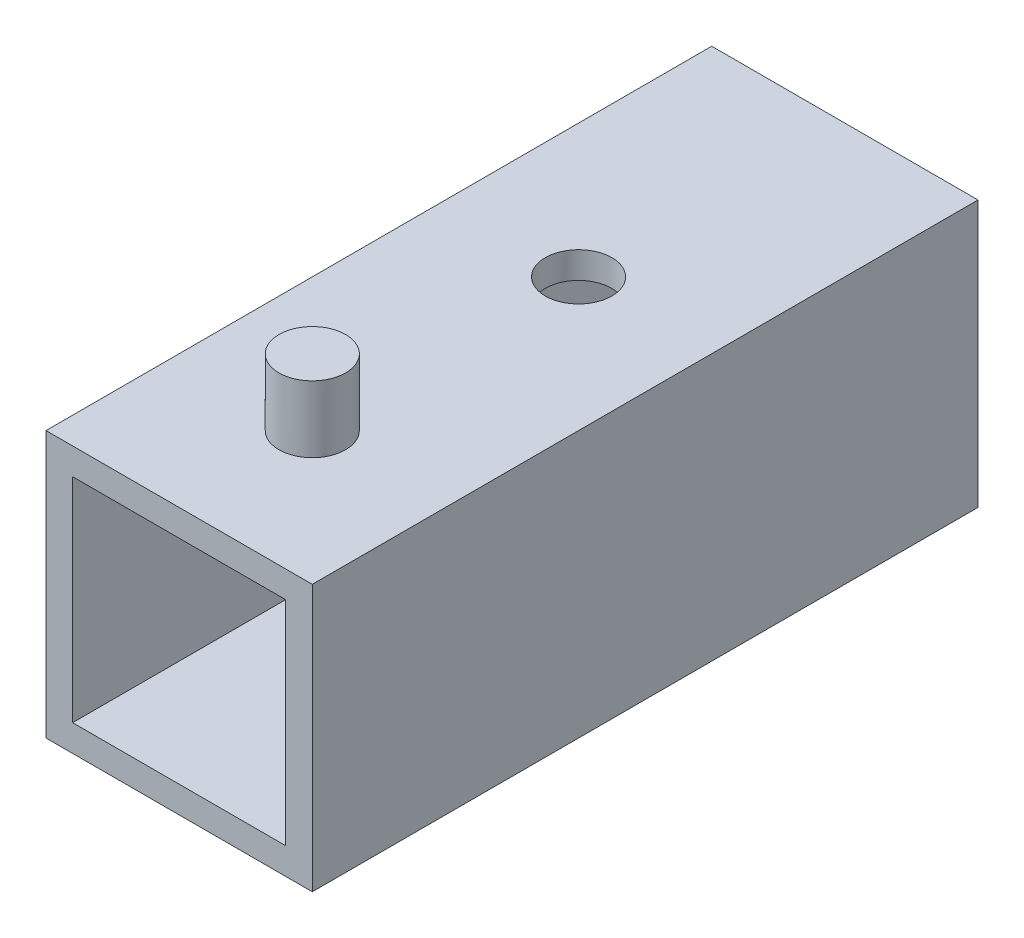
ISO-10303-21;
HEADER;
FILE_DESCRIPTION(('STEP AP214'),'2;1');
FILE_NAME('part.step','',(''),(''),'','','');
FILE_SCHEMA(('AUTOMOTIVE_DESIGN { 1 0 10303 214 1 1 1 1 }'));
ENDSEC;
DATA;
#1=APPLICATION_CONTEXT('core data for automotive mechanical design processes');
#2=APPLICATION_PROTOCOL_DEFINITION('international standard','automotive_design',2000,#1);
#3=PRODUCT_CONTEXT('',#1,'mechanical');
#4=PRODUCT('Part','Part','',(#3));
#5=PRODUCT_RELATED_PRODUCT_CATEGORY('part','',(#4));
#6=PRODUCT_DEFINITION_FORMATION('','',#4);
#7=PRODUCT_DEFINITION_CONTEXT('part definition',#1,'design');
#8=PRODUCT_DEFINITION('design','',#6,#7);
#9=PRODUCT_DEFINITION_SHAPE('','',#8);
#10=(LENGTH_UNIT() NAMED_UNIT(*) SI_UNIT(.MILLI.,.METRE.));
#11=(NAMED_UNIT(*) PLANE_ANGLE_UNIT() SI_UNIT($,.RADIAN.));
#12=(NAMED_UNIT(*) SI_UNIT($,.STERADIAN.) SOLID_ANGLE_UNIT());
#13=UNCERTAINTY_MEASURE_WITH_UNIT(LENGTH_MEASURE(1.E-05),#10,'distance_accuracy_value','');
#14=(GEOMETRIC_REPRESENTATION_CONTEXT(3) GLOBAL_UNCERTAINTY_ASSIGNED_CONTEXT((#13)) GLOBAL_UNIT_ASSIGNED_CONTEXT((#10,
#11,#12)) REPRESENTATION_CONTEXT('',''));
#15=CARTESIAN_POINT('',(0.,0.,0.));
#16=DIRECTION('',(0.,0.,1.));
#17=DIRECTION('',(1.,0.,0.));
#18=AXIS2_PLACEMENT_3D('',#15,#16,#17);
#19=CARTESIAN_POINT('',(0.,0.,31.75));
#20=DIRECTION('',(0.,0.,1.));
#21=DIRECTION('',(1.,0.,0.));
#22=AXIS2_PLACEMENT_3D('',#19,#20,#21);
#23=PLANE('',#22);
#24=DIRECTION('',(0.,1.,0.));
#25=VECTOR('',#24,1.);
#26=CARTESIAN_POINT('',(12.7,-12.7,31.75));
#27=LINE('',#26,#25);
#28=CARTESIAN_POINT('',(12.7,-12.7,31.75));
#29=VERTEX_POINT('',#28);
#30=CARTESIAN_POINT('',(12.7,12.7,31.75));
#31=VERTEX_POINT('',#30);
#32=EDGE_CURVE('E162',#29,#31,#27,.T.);
#33=ORIENTED_EDGE('',*,*,#32,.T.);
#34=DIRECTION('',(-1.,0.,0.));
#35=VECTOR('',#34,1.);
#36=CARTESIAN_POINT('',(-12.7,12.7,31.75));
#37=LINE('',#36,#35);
#38=CARTESIAN_POINT('',(-12.7,12.7,31.75));
#39=VERTEX_POINT('',#38);
#40=EDGE_CURVE('E165',#31,#39,#37,.T.);
#41=ORIENTED_EDGE('',*,*,#40,.T.);
#42=DIRECTION('',(0.,-1.,0.));
#43=VECTOR('',#42,1.);
#44=CARTESIAN_POINT('',(-12.7,-12.7,31.75));
#45=LINE('',#44,#43);
#46=CARTESIAN_POINT('',(-12.7,-12.7,31.75));
#47=VERTEX_POINT('',#46);
#48=EDGE_CURVE('E168',#39,#47,#45,.T.);
#49=ORIENTED_EDGE('',*,*,#48,.T.);
#50=DIRECTION('',(1.,0.,0.));
#51=VECTOR('',#50,1.);
#52=CARTESIAN_POINT('',(-12.7,-12.7,31.75));
#53=LINE('',#52,#51);
#54=EDGE_CURVE('E170',#47,#29,#53,.T.);
#55=ORIENTED_EDGE('',*,*,#54,.T.);
#56=EDGE_LOOP('',(#33,#41,#49,#55));
#57=FACE_BOUND('',#56,.T.);
#58=DIRECTION('',(-1.,0.,0.));
#59=VECTOR('',#58,1.);
#60=CARTESIAN_POINT('',(0.,10.16,31.75));
#61=LINE('',#60,#59);
#62=CARTESIAN_POINT('',(10.16,10.16,31.75));
#63=VERTEX_POINT('',#62);
#64=CARTESIAN_POINT('',(-10.16,10.16,31.75));
#65=VERTEX_POINT('',#64);
#66=EDGE_CURVE('E132',#63,#65,#61,.T.);
#67=ORIENTED_EDGE('',*,*,#66,.F.);
#68=DIRECTION('',(0.,1.,0.));
#69=VECTOR('',#68,1.);
#70=CARTESIAN_POINT('',(10.16,0.,31.75));
#71=LINE('',#70,#69);
#72=CARTESIAN_POINT('',(10.16,-10.16,31.75));
#73=VERTEX_POINT('',#72);
#74=EDGE_CURVE('E124',#73,#63,#71,.T.);
#75=ORIENTED_EDGE('',*,*,#74,.F.);
#76=DIRECTION('',(1.,0.,0.));
#77=VECTOR('',#76,1.);
#78=CARTESIAN_POINT('',(0.,-10.16,31.75));
#79=LINE('',#78,#77);
#80=CARTESIAN_POINT('',(-10.16,-10.16,31.75));
#81=VERTEX_POINT('',#80);
#82=EDGE_CURVE('E146',#81,#73,#79,.T.);
#83=ORIENTED_EDGE('',*,*,#82,.F.);
#84=DIRECTION('',(0.,-1.,0.));
#85=VECTOR('',#84,1.);
#86=CARTESIAN_POINT('',(-10.16,0.,31.75));
#87=LINE('',#86,#85);
#88=EDGE_CURVE('E144',#65,#81,#87,.T.);
#89=ORIENTED_EDGE('',*,*,#88,.F.);
#90=EDGE_LOOP('',(#67,#75,#83,#89));
#91=FACE_BOUND('',#90,.T.);
#92=ADVANCED_FACE('F58',(#57,#91),#23,.T.);
#93=CARTESIAN_POINT('',(0.,0.,-31.75));
#94=DIRECTION('',(0.,0.,1.));
#95=DIRECTION('',(1.,0.,0.));
#96=AXIS2_PLACEMENT_3D('',#93,#94,#95);
#97=PLANE('',#96);
#98=DIRECTION('',(0.,1.,0.));
#99=VECTOR('',#98,1.);
#100=CARTESIAN_POINT('',(12.7,-12.7,-31.75));
#101=LINE('',#100,#99);
#102=CARTESIAN_POINT('',(12.7,-12.7,-31.75));
#103=VERTEX_POINT('',#102);
#104=CARTESIAN_POINT('',(12.7,12.7,-31.75));
#105=VERTEX_POINT('',#104);
#106=EDGE_CURVE('E140',#103,#105,#101,.T.);
#107=ORIENTED_EDGE('',*,*,#106,.F.);
#108=DIRECTION('',(1.,0.,0.));
#109=VECTOR('',#108,1.);
#110=CARTESIAN_POINT('',(-12.7,-12.7,-31.75));
#111=LINE('',#110,#109);
#112=CARTESIAN_POINT('',(-12.7,-12.7,-31.75));
#113=VERTEX_POINT('',#112);
#114=EDGE_CURVE('E166',#113,#103,#111,.T.);
#115=ORIENTED_EDGE('',*,*,#114,.F.);
#116=DIRECTION('',(0.,-1.,0.));
#117=VECTOR('',#116,1.);
#118=CARTESIAN_POINT('',(-12.7,-12.7,-31.75));
#119=LINE('',#118,#117);
#120=CARTESIAN_POINT('',(-12.7,12.7,-31.75));
#121=VERTEX_POINT('',#120);
#122=EDGE_CURVE('E177',#121,#113,#119,.T.);
#123=ORIENTED_EDGE('',*,*,#122,.F.);
#124=DIRECTION('',(-1.,0.,0.));
#125=VECTOR('',#124,1.);
#126=CARTESIAN_POINT('',(-12.7,12.7,-31.75));
#127=LINE('',#126,#125);
#128=EDGE_CURVE('E175',#105,#121,#127,.T.);
#129=ORIENTED_EDGE('',*,*,#128,.F.);
#130=EDGE_LOOP('',(#107,#115,#123,#129));
#131=FACE_BOUND('',#130,.T.);
#132=DIRECTION('',(0.,1.,0.));
#133=VECTOR('',#132,1.);
#134=CARTESIAN_POINT('',(10.16,0.,-31.75));
#135=LINE('',#134,#133);
#136=CARTESIAN_POINT('',(10.16,-10.16,-31.75));
#137=VERTEX_POINT('',#136);
#138=CARTESIAN_POINT('',(10.16,10.16,-31.75));
#139=VERTEX_POINT('',#138);
#140=EDGE_CURVE('E82',#137,#139,#135,.T.);
#141=ORIENTED_EDGE('',*,*,#140,.T.);
#142=DIRECTION('',(-1.,0.,0.));
#143=VECTOR('',#142,1.);
#144=CARTESIAN_POINT('',(0.,10.16,-31.75));
#145=LINE('',#144,#143);
#146=CARTESIAN_POINT('',(-10.16,10.16,-31.75));
#147=VERTEX_POINT('',#146);
#148=EDGE_CURVE('E139',#139,#147,#145,.T.);
#149=ORIENTED_EDGE('',*,*,#148,.T.);
#150=DIRECTION('',(0.,-1.,0.));
#151=VECTOR('',#150,1.);
#152=CARTESIAN_POINT('',(-10.16,0.,-31.75));
#153=LINE('',#152,#151);
#154=CARTESIAN_POINT('',(-10.16,-10.16,-31.75));
#155=VERTEX_POINT('',#154);
#156=EDGE_CURVE('E154',#147,#155,#153,.T.);
#157=ORIENTED_EDGE('',*,*,#156,.T.);
#158=DIRECTION('',(1.,0.,0.));
#159=VECTOR('',#158,1.);
#160=CARTESIAN_POINT('',(0.,-10.16,-31.75));
#161=LINE('',#160,#159);
#162=EDGE_CURVE('E133',#155,#137,#161,.T.);
#163=ORIENTED_EDGE('',*,*,#162,.T.);
#164=EDGE_LOOP('',(#141,#149,#157,#163));
#165=FACE_BOUND('',#164,.T.);
#166=ADVANCED_FACE('F199',(#131,#165),#97,.F.);
#167=CARTESIAN_POINT('',(12.7,-12.7,31.75));
#168=DIRECTION('',(-1.,0.,0.));
#169=DIRECTION('',(0.,0.,1.));
#170=AXIS2_PLACEMENT_3D('',#167,#168,#169);
#171=PLANE('',#170);
#172=ORIENTED_EDGE('',*,*,#106,.T.);
#173=DIRECTION('',(0.,0.,-1.));
#174=VECTOR('',#173,1.);
#175=CARTESIAN_POINT('',(12.7,12.7,31.75));
#176=LINE('',#175,#174);
#177=EDGE_CURVE('E67',#31,#105,#176,.T.);
#178=ORIENTED_EDGE('',*,*,#177,.F.);
#179=ORIENTED_EDGE('',*,*,#32,.F.);
#180=DIRECTION('',(0.,0.,-1.));
#181=VECTOR('',#180,1.);
#182=CARTESIAN_POINT('',(12.7,-12.7,31.75));
#183=LINE('',#182,#181);
#184=EDGE_CURVE('E172',#29,#103,#183,.T.);
#185=ORIENTED_EDGE('',*,*,#184,.T.);
#186=EDGE_LOOP('',(#172,#178,#179,#185));
#187=FACE_BOUND('',#186,.T.);
#188=ADVANCED_FACE('F60',(#187),#171,.F.);
#189=CARTESIAN_POINT('',(-12.7,12.7,31.75));
#190=DIRECTION('',(0.,-1.,0.));
#191=DIRECTION('',(0.,0.,-1.));
#192=AXIS2_PLACEMENT_3D('',#189,#190,#191);
#193=PLANE('',#192);
#194=CARTESIAN_POINT('',(0.,12.7,-6.35));
#195=DIRECTION('',(0.,1.,0.));
#196=DIRECTION('',(0.,0.,1.));
#197=AXIS2_PLACEMENT_3D('',#194,#195,#196);
#198=CIRCLE('',#197,3.175);
#199=CARTESIAN_POINT('',(0.,12.7,-3.175));
#200=VERTEX_POINT('',#199);
#201=EDGE_CURVE('E231',#200,#200,#198,.T.);
#202=ORIENTED_EDGE('',*,*,#201,.F.);
#203=EDGE_LOOP('',(#202));
#204=FACE_BOUND('',#203,.T.);
#205=CARTESIAN_POINT('',(0.,12.7,19.05));
#206=DIRECTION('',(0.,-1.,0.));
#207=DIRECTION('',(0.,0.,-1.));
#208=AXIS2_PLACEMENT_3D('',#205,#206,#207);
#209=CIRCLE('',#208,3.175);
#210=CARTESIAN_POINT('',(0.,12.7,15.875));
#211=VERTEX_POINT('',#210);
#212=EDGE_CURVE('E12',#211,#211,#209,.F.);
#213=ORIENTED_EDGE('',*,*,#212,.F.);
#214=EDGE_LOOP('',(#213));
#215=FACE_BOUND('',#214,.T.);
#216=ORIENTED_EDGE('',*,*,#128,.T.);
#217=DIRECTION('',(0.,0.,-1.));
#218=VECTOR('',#217,1.);
#219=CARTESIAN_POINT('',(-12.7,12.7,31.75));
#220=LINE('',#219,#218);
#221=EDGE_CURVE('E185',#39,#121,#220,.T.);
#222=ORIENTED_EDGE('',*,*,#221,.F.);
#223=ORIENTED_EDGE('',*,*,#40,.F.);
#224=ORIENTED_EDGE('',*,*,#177,.T.);
#225=EDGE_LOOP('',(#216,#222,#223,#224));
#226=FACE_BOUND('',#225,.T.);
#227=ADVANCED_FACE('F191',(#204,#215,#226),#193,.F.);
#228=CARTESIAN_POINT('',(-12.7,-12.7,31.75));
#229=DIRECTION('',(1.,0.,0.));
#230=DIRECTION('',(0.,0.,-1.));
#231=AXIS2_PLACEMENT_3D('',#228,#229,#230);
#232=PLANE('',#231);
#233=ORIENTED_EDGE('',*,*,#122,.T.);
#234=DIRECTION('',(0.,0.,-1.));
#235=VECTOR('',#234,1.);
#236=CARTESIAN_POINT('',(-12.7,-12.7,31.75));
#237=LINE('',#236,#235);
#238=EDGE_CURVE('E182',#47,#113,#237,.T.);
#239=ORIENTED_EDGE('',*,*,#238,.F.);
#240=ORIENTED_EDGE('',*,*,#48,.F.);
#241=ORIENTED_EDGE('',*,*,#221,.T.);
#242=EDGE_LOOP('',(#233,#239,#240,#241));
#243=FACE_BOUND('',#242,.T.);
#244=ADVANCED_FACE('F204',(#243),#232,.F.);
#245=CARTESIAN_POINT('',(-12.7,-12.7,31.75));
#246=DIRECTION('',(0.,1.,0.));
#247=DIRECTION('',(0.,0.,1.));
#248=AXIS2_PLACEMENT_3D('',#245,#246,#247);
#249=PLANE('',#248);
#250=CARTESIAN_POINT('',(0.,-12.7,-6.35));
#251=DIRECTION('',(0.,1.,0.));
#252=DIRECTION('',(0.,0.,1.));
#253=AXIS2_PLACEMENT_3D('',#250,#251,#252);
#254=CIRCLE('',#253,3.175);
#255=CARTESIAN_POINT('',(0.,-12.7,-3.175));
#256=VERTEX_POINT('',#255);
#257=EDGE_CURVE('E267',#256,#256,#254,.T.);
#258=ORIENTED_EDGE('',*,*,#257,.T.);
#259=EDGE_LOOP('',(#258));
#260=FACE_BOUND('',#259,.T.);
#261=ORIENTED_EDGE('',*,*,#114,.T.);
#262=ORIENTED_EDGE('',*,*,#184,.F.);
#263=ORIENTED_EDGE('',*,*,#54,.F.);
#264=ORIENTED_EDGE('',*,*,#238,.T.);
#265=EDGE_LOOP('',(#261,#262,#263,#264));
#266=FACE_BOUND('',#265,.T.);
#267=ADVANCED_FACE('F208',(#260,#266),#249,.F.);
#268=CARTESIAN_POINT('',(10.16,0.,31.75));
#269=DIRECTION('',(-1.,0.,0.));
#270=DIRECTION('',(0.,0.,1.));
#271=AXIS2_PLACEMENT_3D('',#268,#269,#270);
#272=PLANE('',#271);
#273=ORIENTED_EDGE('',*,*,#140,.F.);
#274=DIRECTION('',(0.,0.,-1.));
#275=VECTOR('',#274,1.);
#276=CARTESIAN_POINT('',(10.16,-10.16,31.75));
#277=LINE('',#276,#275);
#278=EDGE_CURVE('E128',#73,#137,#277,.T.);
#279=ORIENTED_EDGE('',*,*,#278,.F.);
#280=ORIENTED_EDGE('',*,*,#74,.T.);
#281=DIRECTION('',(0.,0.,-1.));
#282=VECTOR('',#281,1.);
#283=CARTESIAN_POINT('',(10.16,10.16,31.75));
#284=LINE('',#283,#282);
#285=EDGE_CURVE('E127',#63,#139,#284,.T.);
#286=ORIENTED_EDGE('',*,*,#285,.T.);
#287=EDGE_LOOP('',(#273,#279,#280,#286));
#288=FACE_BOUND('',#287,.T.);
#289=ADVANCED_FACE('F126',(#288),#272,.T.);
#290=CARTESIAN_POINT('',(0.,10.16,31.75));
#291=DIRECTION('',(0.,-1.,0.));
#292=DIRECTION('',(0.,0.,-1.));
#293=AXIS2_PLACEMENT_3D('',#290,#291,#292);
#294=PLANE('',#293);
#295=CARTESIAN_POINT('',(0.,10.16,-6.35));
#296=DIRECTION('',(0.,-1.,0.));
#297=DIRECTION('',(0.,0.,-1.));
#298=AXIS2_PLACEMENT_3D('',#295,#296,#297);
#299=CIRCLE('',#298,3.175);
#300=CARTESIAN_POINT('',(0.,10.16,-9.525));
#301=VERTEX_POINT('',#300);
#302=EDGE_CURVE('E262',#301,#301,#299,.T.);
#303=ORIENTED_EDGE('',*,*,#302,.F.);
#304=EDGE_LOOP('',(#303));
#305=FACE_BOUND('',#304,.T.);
#306=ORIENTED_EDGE('',*,*,#148,.F.);
#307=ORIENTED_EDGE('',*,*,#285,.F.);
#308=ORIENTED_EDGE('',*,*,#66,.T.);
#309=DIRECTION('',(0.,0.,-1.));
#310=VECTOR('',#309,1.);
#311=CARTESIAN_POINT('',(-10.16,10.16,31.75));
#312=LINE('',#311,#310);
#313=EDGE_CURVE('E141',#65,#147,#312,.T.);
#314=ORIENTED_EDGE('',*,*,#313,.T.);
#315=EDGE_LOOP('',(#306,#307,#308,#314));
#316=FACE_BOUND('',#315,.T.);
#317=ADVANCED_FACE('F136',(#305,#316),#294,.T.);
#318=CARTESIAN_POINT('',(-10.16,0.,31.75));
#319=DIRECTION('',(1.,0.,0.));
#320=DIRECTION('',(0.,0.,-1.));
#321=AXIS2_PLACEMENT_3D('',#318,#319,#320);
#322=PLANE('',#321);
#323=ORIENTED_EDGE('',*,*,#156,.F.);
#324=ORIENTED_EDGE('',*,*,#313,.F.);
#325=ORIENTED_EDGE('',*,*,#88,.T.);
#326=DIRECTION('',(0.,0.,-1.));
#327=VECTOR('',#326,1.);
#328=CARTESIAN_POINT('',(-10.16,-10.16,31.75));
#329=LINE('',#328,#327);
#330=EDGE_CURVE('E74',#81,#155,#329,.T.);
#331=ORIENTED_EDGE('',*,*,#330,.T.);
#332=EDGE_LOOP('',(#323,#324,#325,#331));
#333=FACE_BOUND('',#332,.T.);
#334=ADVANCED_FACE('F247',(#333),#322,.T.);
#335=CARTESIAN_POINT('',(0.,-10.16,31.75));
#336=DIRECTION('',(0.,1.,0.));
#337=DIRECTION('',(0.,0.,1.));
#338=AXIS2_PLACEMENT_3D('',#335,#336,#337);
#339=PLANE('',#338);
#340=CARTESIAN_POINT('',(0.,-10.16,-6.35));
#341=DIRECTION('',(0.,1.,0.));
#342=DIRECTION('',(0.,0.,1.));
#343=AXIS2_PLACEMENT_3D('',#340,#341,#342);
#344=CIRCLE('',#343,3.175);
#345=CARTESIAN_POINT('',(0.,-10.16,-3.175));
#346=VERTEX_POINT('',#345);
#347=EDGE_CURVE('E62',#346,#346,#344,.T.);
#348=ORIENTED_EDGE('',*,*,#347,.F.);
#349=EDGE_LOOP('',(#348));
#350=FACE_BOUND('',#349,.T.);
#351=ORIENTED_EDGE('',*,*,#162,.F.);
#352=ORIENTED_EDGE('',*,*,#330,.F.);
#353=ORIENTED_EDGE('',*,*,#82,.T.);
#354=ORIENTED_EDGE('',*,*,#278,.T.);
#355=EDGE_LOOP('',(#351,#352,#353,#354));
#356=FACE_BOUND('',#355,.T.);
#357=ADVANCED_FACE('F237',(#350,#356),#339,.T.);
#358=CARTESIAN_POINT('',(0.,19.05,19.05));
#359=DIRECTION('',(0.,-1.,0.));
#360=DIRECTION('',(0.,0.,-1.));
#361=AXIS2_PLACEMENT_3D('',#358,#359,#360);
#362=CYLINDRICAL_SURFACE('',#361,3.175);
#363=CARTESIAN_POINT('',(0.,19.05,19.05));
#364=DIRECTION('',(0.,1.,0.));
#365=DIRECTION('',(0.,0.,1.));
#366=AXIS2_PLACEMENT_3D('',#363,#364,#365);
#367=CIRCLE('',#366,3.175);
#368=CARTESIAN_POINT('',(0.,19.05,22.225));
#369=VERTEX_POINT('',#368);
#370=EDGE_CURVE('E152',#369,#369,#367,.T.);
#371=ORIENTED_EDGE('',*,*,#370,.F.);
#372=EDGE_LOOP('',(#371));
#373=FACE_BOUND('',#372,.T.);
#374=ORIENTED_EDGE('',*,*,#212,.T.);
#375=EDGE_LOOP('',(#374));
#376=FACE_BOUND('',#375,.T.);
#377=ADVANCED_FACE('F234',(#373,#376),#362,.T.);
#378=CARTESIAN_POINT('',(0.,19.05,19.05));
#379=DIRECTION('',(0.,1.,0.));
#380=DIRECTION('',(0.,0.,1.));
#381=AXIS2_PLACEMENT_3D('',#378,#379,#380);
#382=PLANE('',#381);
#383=ORIENTED_EDGE('',*,*,#370,.T.);
#384=EDGE_LOOP('',(#383));
#385=FACE_BOUND('',#384,.T.);
#386=ADVANCED_FACE('F236',(#385),#382,.T.);
#387=CARTESIAN_POINT('',(0.,-12.7,-6.35));
#388=DIRECTION('',(0.,1.,0.));
#389=DIRECTION('',(0.,0.,1.));
#390=AXIS2_PLACEMENT_3D('',#387,#388,#389);
#391=CYLINDRICAL_SURFACE('',#390,3.175);
#392=ORIENTED_EDGE('',*,*,#347,.T.);
#393=EDGE_LOOP('',(#392));
#394=FACE_BOUND('',#393,.T.);
#395=ORIENTED_EDGE('',*,*,#257,.F.);
#396=EDGE_LOOP('',(#395));
#397=FACE_BOUND('',#396,.T.);
#398=ADVANCED_FACE('F244',(#394,#397),#391,.F.);
#399=ORIENTED_EDGE('',*,*,#302,.T.);
#400=EDGE_LOOP('',(#399));
#401=FACE_BOUND('',#400,.T.);
#402=ORIENTED_EDGE('',*,*,#201,.T.);
#403=EDGE_LOOP('',(#402));
#404=FACE_BOUND('',#403,.T.);
#405=ADVANCED_FACE('F274',(#401,#404),#391,.F.);
#406=CLOSED_SHELL('',(#92,#166,#188,#227,#244,#267,#289,#317,#334,#357,#377,#386,#398,#405));
#407=MANIFOLD_SOLID_BREP('B2',#406);
#408=ADVANCED_BREP_SHAPE_REPRESENTATION('',(#18,#407),#14);
#409=SHAPE_DEFINITION_REPRESENTATION(#9,#408);
ENDSEC;
END-ISO-10303-21;
